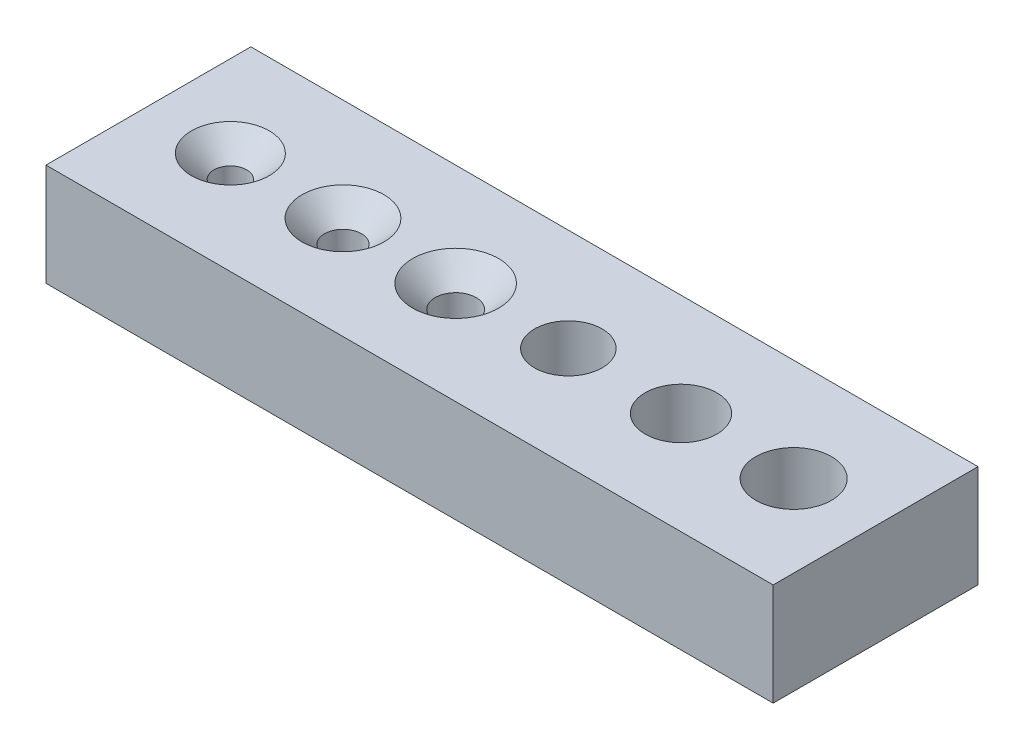
ISO-10303-21;
HEADER;
FILE_DESCRIPTION(('STEP AP214'),'2;1');
FILE_NAME('part.step','',(''),(''),'','','');
FILE_SCHEMA(('AUTOMOTIVE_DESIGN { 1 0 10303 214 1 1 1 1 }'));
ENDSEC;
DATA;
#1=APPLICATION_CONTEXT('core data for automotive mechanical design processes');
#2=APPLICATION_PROTOCOL_DEFINITION('international standard','automotive_design',2000,#1);
#3=PRODUCT_CONTEXT('',#1,'mechanical');
#4=PRODUCT('Part','Part','',(#3));
#5=PRODUCT_RELATED_PRODUCT_CATEGORY('part','',(#4));
#6=PRODUCT_DEFINITION_FORMATION('','',#4);
#7=PRODUCT_DEFINITION_CONTEXT('part definition',#1,'design');
#8=PRODUCT_DEFINITION('design','',#6,#7);
#9=PRODUCT_DEFINITION_SHAPE('','',#8);
#10=(LENGTH_UNIT() NAMED_UNIT(*) SI_UNIT(.MILLI.,.METRE.));
#11=(NAMED_UNIT(*) PLANE_ANGLE_UNIT() SI_UNIT($,.RADIAN.));
#12=(NAMED_UNIT(*) SI_UNIT($,.STERADIAN.) SOLID_ANGLE_UNIT());
#13=UNCERTAINTY_MEASURE_WITH_UNIT(LENGTH_MEASURE(1.E-05),#10,'distance_accuracy_value','');
#14=(GEOMETRIC_REPRESENTATION_CONTEXT(3) GLOBAL_UNCERTAINTY_ASSIGNED_CONTEXT((#13)) GLOBAL_UNIT_ASSIGNED_CONTEXT((#10,
#11,#12)) REPRESENTATION_CONTEXT('',''));
#15=CARTESIAN_POINT('',(0.,0.,0.));
#16=DIRECTION('',(0.,0.,1.));
#17=DIRECTION('',(1.,0.,0.));
#18=AXIS2_PLACEMENT_3D('',#15,#16,#17);
#19=CARTESIAN_POINT('',(0.,5.,0.));
#20=DIRECTION('',(1.,0.,0.));
#21=DIRECTION('',(0.,0.,-1.));
#22=AXIS2_PLACEMENT_3D('',#19,#20,#21);
#23=PLANE('',#22);
#24=DIRECTION('',(0.,0.,1.));
#25=VECTOR('',#24,1.);
#26=CARTESIAN_POINT('',(0.,0.,0.));
#27=LINE('',#26,#25);
#28=CARTESIAN_POINT('',(0.,0.,-10.));
#29=VERTEX_POINT('',#28);
#30=CARTESIAN_POINT('',(0.,0.,0.));
#31=VERTEX_POINT('',#30);
#32=EDGE_CURVE('E102',#29,#31,#27,.T.);
#33=ORIENTED_EDGE('',*,*,#32,.T.);
#34=DIRECTION('',(0.,-1.,0.));
#35=VECTOR('',#34,1.);
#36=CARTESIAN_POINT('',(0.,5.,0.));
#37=LINE('',#36,#35);
#38=CARTESIAN_POINT('',(0.,5.,0.));
#39=VERTEX_POINT('',#38);
#40=EDGE_CURVE('E11',#39,#31,#37,.T.);
#41=ORIENTED_EDGE('',*,*,#40,.F.);
#42=DIRECTION('',(0.,0.,1.));
#43=VECTOR('',#42,1.);
#44=CARTESIAN_POINT('',(0.,5.,0.));
#45=LINE('',#44,#43);
#46=CARTESIAN_POINT('',(0.,5.,-10.));
#47=VERTEX_POINT('',#46);
#48=EDGE_CURVE('E89',#47,#39,#45,.T.);
#49=ORIENTED_EDGE('',*,*,#48,.F.);
#50=DIRECTION('',(0.,-1.,0.));
#51=VECTOR('',#50,1.);
#52=CARTESIAN_POINT('',(0.,5.,-10.));
#53=LINE('',#52,#51);
#54=EDGE_CURVE('E98',#47,#29,#53,.T.);
#55=ORIENTED_EDGE('',*,*,#54,.T.);
#56=EDGE_LOOP('',(#33,#41,#49,#55));
#57=FACE_BOUND('',#56,.T.);
#58=ADVANCED_FACE('F36',(#57),#23,.F.);
#59=CARTESIAN_POINT('',(0.,5.,0.));
#60=DIRECTION('',(0.,0.,-1.));
#61=DIRECTION('',(-1.,0.,0.));
#62=AXIS2_PLACEMENT_3D('',#59,#60,#61);
#63=PLANE('',#62);
#64=DIRECTION('',(1.,0.,0.));
#65=VECTOR('',#64,1.);
#66=CARTESIAN_POINT('',(0.,0.,0.));
#67=LINE('',#66,#65);
#68=CARTESIAN_POINT('',(35.5,0.,0.));
#69=VERTEX_POINT('',#68);
#70=EDGE_CURVE('E93',#31,#69,#67,.T.);
#71=ORIENTED_EDGE('',*,*,#70,.T.);
#72=DIRECTION('',(0.,-1.,0.));
#73=VECTOR('',#72,1.);
#74=CARTESIAN_POINT('',(35.5,5.,0.));
#75=LINE('',#74,#73);
#76=CARTESIAN_POINT('',(35.5,5.,0.));
#77=VERTEX_POINT('',#76);
#78=EDGE_CURVE('E45',#77,#69,#75,.T.);
#79=ORIENTED_EDGE('',*,*,#78,.F.);
#80=DIRECTION('',(1.,0.,0.));
#81=VECTOR('',#80,1.);
#82=CARTESIAN_POINT('',(0.,5.,0.));
#83=LINE('',#82,#81);
#84=EDGE_CURVE('E84',#39,#77,#83,.T.);
#85=ORIENTED_EDGE('',*,*,#84,.F.);
#86=ORIENTED_EDGE('',*,*,#40,.T.);
#87=EDGE_LOOP('',(#71,#79,#85,#86));
#88=FACE_BOUND('',#87,.T.);
#89=ADVANCED_FACE('F92',(#88),#63,.F.);
#90=CARTESIAN_POINT('',(35.5,5.,0.));
#91=DIRECTION('',(-1.,0.,0.));
#92=DIRECTION('',(0.,0.,1.));
#93=AXIS2_PLACEMENT_3D('',#90,#91,#92);
#94=PLANE('',#93);
#95=DIRECTION('',(0.,0.,-1.));
#96=VECTOR('',#95,1.);
#97=CARTESIAN_POINT('',(35.5,0.,0.));
#98=LINE('',#97,#96);
#99=CARTESIAN_POINT('',(35.5,0.,-10.));
#100=VERTEX_POINT('',#99);
#101=EDGE_CURVE('E71',#69,#100,#98,.T.);
#102=ORIENTED_EDGE('',*,*,#101,.T.);
#103=DIRECTION('',(0.,-1.,0.));
#104=VECTOR('',#103,1.);
#105=CARTESIAN_POINT('',(35.5,5.,-10.));
#106=LINE('',#105,#104);
#107=CARTESIAN_POINT('',(35.5,5.,-10.));
#108=VERTEX_POINT('',#107);
#109=EDGE_CURVE('E94',#108,#100,#106,.T.);
#110=ORIENTED_EDGE('',*,*,#109,.F.);
#111=DIRECTION('',(0.,0.,-1.));
#112=VECTOR('',#111,1.);
#113=CARTESIAN_POINT('',(35.5,5.,0.));
#114=LINE('',#113,#112);
#115=EDGE_CURVE('E87',#77,#108,#114,.T.);
#116=ORIENTED_EDGE('',*,*,#115,.F.);
#117=ORIENTED_EDGE('',*,*,#78,.T.);
#118=EDGE_LOOP('',(#102,#110,#116,#117));
#119=FACE_BOUND('',#118,.T.);
#120=ADVANCED_FACE('F96',(#119),#94,.F.);
#121=CARTESIAN_POINT('',(0.,5.,-10.));
#122=DIRECTION('',(0.,0.,1.));
#123=DIRECTION('',(1.,0.,0.));
#124=AXIS2_PLACEMENT_3D('',#121,#122,#123);
#125=PLANE('',#124);
#126=DIRECTION('',(-1.,0.,0.));
#127=VECTOR('',#126,1.);
#128=CARTESIAN_POINT('',(0.,0.,-10.));
#129=LINE('',#128,#127);
#130=EDGE_CURVE('E77',#100,#29,#129,.T.);
#131=ORIENTED_EDGE('',*,*,#130,.T.);
#132=ORIENTED_EDGE('',*,*,#54,.F.);
#133=DIRECTION('',(-1.,0.,0.));
#134=VECTOR('',#133,1.);
#135=CARTESIAN_POINT('',(0.,5.,-10.));
#136=LINE('',#135,#134);
#137=EDGE_CURVE('E54',#108,#47,#136,.T.);
#138=ORIENTED_EDGE('',*,*,#137,.F.);
#139=ORIENTED_EDGE('',*,*,#109,.T.);
#140=EDGE_LOOP('',(#131,#132,#138,#139));
#141=FACE_BOUND('',#140,.T.);
#142=ADVANCED_FACE('F144',(#141),#125,.F.);
#143=CARTESIAN_POINT('',(0.,5.,0.));
#144=DIRECTION('',(0.,-1.,0.));
#145=DIRECTION('',(0.,0.,-1.));
#146=AXIS2_PLACEMENT_3D('',#143,#144,#145);
#147=PLANE('',#146);
#148=CARTESIAN_POINT('',(31.5,5.,-5.));
#149=DIRECTION('',(0.,1.,0.));
#150=DIRECTION('',(0.,0.,1.));
#151=AXIS2_PLACEMENT_3D('',#148,#149,#150);
#152=CIRCLE('',#151,1.85);
#153=CARTESIAN_POINT('',(31.5,5.,-3.15));
#154=VERTEX_POINT('',#153);
#155=EDGE_CURVE('E275',#154,#154,#152,.T.);
#156=ORIENTED_EDGE('',*,*,#155,.F.);
#157=EDGE_LOOP('',(#156));
#158=FACE_BOUND('',#157,.T.);
#159=CARTESIAN_POINT('',(26.,5.,-5.));
#160=DIRECTION('',(0.,1.,0.));
#161=DIRECTION('',(0.,0.,1.));
#162=AXIS2_PLACEMENT_3D('',#159,#160,#161);
#163=CIRCLE('',#162,1.75);
#164=CARTESIAN_POINT('',(26.,5.,-3.25));
#165=VERTEX_POINT('',#164);
#166=EDGE_CURVE('E277',#165,#165,#163,.T.);
#167=ORIENTED_EDGE('',*,*,#166,.F.);
#168=EDGE_LOOP('',(#167));
#169=FACE_BOUND('',#168,.T.);
#170=CARTESIAN_POINT('',(20.5,5.,-5.));
#171=DIRECTION('',(0.,1.,0.));
#172=DIRECTION('',(0.,0.,1.));
#173=AXIS2_PLACEMENT_3D('',#170,#171,#172);
#174=CIRCLE('',#173,1.64999999999999);
#175=CARTESIAN_POINT('',(20.5,5.,-3.35000000000001));
#176=VERTEX_POINT('',#175);
#177=EDGE_CURVE('E285',#176,#176,#174,.T.);
#178=ORIENTED_EDGE('',*,*,#177,.F.);
#179=EDGE_LOOP('',(#178));
#180=FACE_BOUND('',#179,.T.);
#181=CARTESIAN_POINT('',(4.,5.,-5.));
#182=DIRECTION('',(0.,1.,0.));
#183=DIRECTION('',(0.,0.,1.));
#184=AXIS2_PLACEMENT_3D('',#181,#182,#183);
#185=CIRCLE('',#184,1.9);
#186=CARTESIAN_POINT('',(4.,5.,-3.1));
#187=VERTEX_POINT('',#186);
#188=EDGE_CURVE('E291',#187,#187,#185,.T.);
#189=ORIENTED_EDGE('',*,*,#188,.F.);
#190=EDGE_LOOP('',(#189));
#191=FACE_BOUND('',#190,.T.);
#192=CARTESIAN_POINT('',(15.,5.,-5.));
#193=DIRECTION('',(0.,1.,0.));
#194=DIRECTION('',(0.,0.,1.));
#195=AXIS2_PLACEMENT_3D('',#192,#193,#194);
#196=CIRCLE('',#195,2.1);
#197=CARTESIAN_POINT('',(15.,5.,-2.9));
#198=VERTEX_POINT('',#197);
#199=EDGE_CURVE('E122',#198,#198,#196,.T.);
#200=ORIENTED_EDGE('',*,*,#199,.F.);
#201=EDGE_LOOP('',(#200));
#202=FACE_BOUND('',#201,.T.);
#203=CARTESIAN_POINT('',(9.5,5.,-5.));
#204=DIRECTION('',(0.,1.,0.));
#205=DIRECTION('',(0.,0.,1.));
#206=AXIS2_PLACEMENT_3D('',#203,#204,#205);
#207=CIRCLE('',#206,2.);
#208=CARTESIAN_POINT('',(9.5,5.,-3.));
#209=VERTEX_POINT('',#208);
#210=EDGE_CURVE('E115',#209,#209,#207,.T.);
#211=ORIENTED_EDGE('',*,*,#210,.F.);
#212=EDGE_LOOP('',(#211));
#213=FACE_BOUND('',#212,.T.);
#214=ORIENTED_EDGE('',*,*,#48,.T.);
#215=ORIENTED_EDGE('',*,*,#84,.T.);
#216=ORIENTED_EDGE('',*,*,#115,.T.);
#217=ORIENTED_EDGE('',*,*,#137,.T.);
#218=EDGE_LOOP('',(#214,#215,#216,#217));
#219=FACE_BOUND('',#218,.T.);
#220=ADVANCED_FACE('F85',(#158,#169,#180,#191,#202,#213,#219),#147,.F.);
#221=CARTESIAN_POINT('',(0.,0.,0.));
#222=DIRECTION('',(0.,-1.,0.));
#223=DIRECTION('',(0.,0.,-1.));
#224=AXIS2_PLACEMENT_3D('',#221,#222,#223);
#225=PLANE('',#224);
#226=CARTESIAN_POINT('',(31.5,0.,-5.));
#227=DIRECTION('',(0.,1.,0.));
#228=DIRECTION('',(0.,0.,1.));
#229=AXIS2_PLACEMENT_3D('',#226,#227,#228);
#230=CIRCLE('',#229,1.85);
#231=CARTESIAN_POINT('',(31.5,0.,-3.15));
#232=VERTEX_POINT('',#231);
#233=EDGE_CURVE('E273',#232,#232,#230,.T.);
#234=ORIENTED_EDGE('',*,*,#233,.T.);
#235=EDGE_LOOP('',(#234));
#236=FACE_BOUND('',#235,.T.);
#237=CARTESIAN_POINT('',(26.,0.,-5.));
#238=DIRECTION('',(0.,1.,0.));
#239=DIRECTION('',(0.,0.,1.));
#240=AXIS2_PLACEMENT_3D('',#237,#238,#239);
#241=CIRCLE('',#240,1.75);
#242=CARTESIAN_POINT('',(26.,0.,-3.25));
#243=VERTEX_POINT('',#242);
#244=EDGE_CURVE('E282',#243,#243,#241,.T.);
#245=ORIENTED_EDGE('',*,*,#244,.T.);
#246=EDGE_LOOP('',(#245));
#247=FACE_BOUND('',#246,.T.);
#248=CARTESIAN_POINT('',(20.5,0.,-5.));
#249=DIRECTION('',(0.,1.,0.));
#250=DIRECTION('',(0.,0.,1.));
#251=AXIS2_PLACEMENT_3D('',#248,#249,#250);
#252=CIRCLE('',#251,1.65);
#253=CARTESIAN_POINT('',(20.5,0.,-3.35));
#254=VERTEX_POINT('',#253);
#255=EDGE_CURVE('E288',#254,#254,#252,.T.);
#256=ORIENTED_EDGE('',*,*,#255,.T.);
#257=EDGE_LOOP('',(#256));
#258=FACE_BOUND('',#257,.T.);
#259=CARTESIAN_POINT('',(4.,0.,-5.));
#260=DIRECTION('',(0.,-1.,0.));
#261=DIRECTION('',(0.,0.,-1.));
#262=AXIS2_PLACEMENT_3D('',#259,#260,#261);
#263=CIRCLE('',#262,0.799999999999999);
#264=CARTESIAN_POINT('',(4.,0.,-5.8));
#265=VERTEX_POINT('',#264);
#266=EDGE_CURVE('E39',#265,#265,#263,.T.);
#267=ORIENTED_EDGE('',*,*,#266,.F.);
#268=EDGE_LOOP('',(#267));
#269=FACE_BOUND('',#268,.T.);
#270=CARTESIAN_POINT('',(15.,0.,-5.));
#271=DIRECTION('',(0.,-1.,0.));
#272=DIRECTION('',(0.,0.,-1.));
#273=AXIS2_PLACEMENT_3D('',#270,#271,#272);
#274=CIRCLE('',#273,0.999999999999997);
#275=CARTESIAN_POINT('',(15.,0.,-6.));
#276=VERTEX_POINT('',#275);
#277=EDGE_CURVE('E113',#276,#276,#274,.T.);
#278=ORIENTED_EDGE('',*,*,#277,.F.);
#279=EDGE_LOOP('',(#278));
#280=FACE_BOUND('',#279,.T.);
#281=CARTESIAN_POINT('',(9.5,0.,-5.));
#282=DIRECTION('',(0.,-1.,0.));
#283=DIRECTION('',(0.,0.,-1.));
#284=AXIS2_PLACEMENT_3D('',#281,#282,#283);
#285=CIRCLE('',#284,0.899999999999994);
#286=CARTESIAN_POINT('',(9.5,0.,-5.89999999999999));
#287=VERTEX_POINT('',#286);
#288=EDGE_CURVE('E105',#287,#287,#285,.T.);
#289=ORIENTED_EDGE('',*,*,#288,.F.);
#290=EDGE_LOOP('',(#289));
#291=FACE_BOUND('',#290,.T.);
#292=ORIENTED_EDGE('',*,*,#32,.F.);
#293=ORIENTED_EDGE('',*,*,#130,.F.);
#294=ORIENTED_EDGE('',*,*,#101,.F.);
#295=ORIENTED_EDGE('',*,*,#70,.F.);
#296=EDGE_LOOP('',(#292,#293,#294,#295));
#297=FACE_BOUND('',#296,.T.);
#298=ADVANCED_FACE('F143',(#236,#247,#258,#269,#280,#291,#297),#225,.T.);
#299=CARTESIAN_POINT('',(9.5,5.,-5.));
#300=DIRECTION('',(0.,1.,0.));
#301=DIRECTION('',(0.,0.,1.));
#302=AXIS2_PLACEMENT_3D('',#299,#300,#301);
#303=CYLINDRICAL_SURFACE('',#302,0.899999999999994);
#304=ORIENTED_EDGE('',*,*,#288,.T.);
#305=EDGE_LOOP('',(#304));
#306=FACE_BOUND('',#305,.T.);
#307=CARTESIAN_POINT('',(9.5,3.9,-5.));
#308=DIRECTION('',(0.,1.,0.));
#309=DIRECTION('',(0.,0.,1.));
#310=AXIS2_PLACEMENT_3D('',#307,#308,#309);
#311=CIRCLE('',#310,0.9);
#312=CARTESIAN_POINT('',(9.5,3.9,-4.1));
#313=VERTEX_POINT('',#312);
#314=EDGE_CURVE('E112',#313,#313,#311,.T.);
#315=ORIENTED_EDGE('',*,*,#314,.T.);
#316=EDGE_LOOP('',(#315));
#317=FACE_BOUND('',#316,.T.);
#318=ADVANCED_FACE('F133',(#306,#317),#303,.F.);
#319=CARTESIAN_POINT('',(9.5,5.,-5.));
#320=DIRECTION('',(0.,1.,0.));
#321=DIRECTION('',(0.,0.,1.));
#322=AXIS2_PLACEMENT_3D('',#319,#320,#321);
#323=CONICAL_SURFACE('',#322,2.,0.785398163397448);
#324=ORIENTED_EDGE('',*,*,#314,.F.);
#325=EDGE_LOOP('',(#324));
#326=FACE_BOUND('',#325,.T.);
#327=ORIENTED_EDGE('',*,*,#210,.T.);
#328=EDGE_LOOP('',(#327));
#329=FACE_BOUND('',#328,.T.);
#330=ADVANCED_FACE('F135',(#326,#329),#323,.F.);
#331=CARTESIAN_POINT('',(15.,5.,-5.));
#332=DIRECTION('',(0.,1.,0.));
#333=DIRECTION('',(0.,0.,1.));
#334=AXIS2_PLACEMENT_3D('',#331,#332,#333);
#335=CYLINDRICAL_SURFACE('',#334,0.999999999999997);
#336=ORIENTED_EDGE('',*,*,#277,.T.);
#337=EDGE_LOOP('',(#336));
#338=FACE_BOUND('',#337,.T.);
#339=CARTESIAN_POINT('',(15.,3.9,-5.));
#340=DIRECTION('',(0.,1.,0.));
#341=DIRECTION('',(0.,0.,1.));
#342=AXIS2_PLACEMENT_3D('',#339,#340,#341);
#343=CIRCLE('',#342,0.999999999999997);
#344=CARTESIAN_POINT('',(15.,3.9,-4.));
#345=VERTEX_POINT('',#344);
#346=EDGE_CURVE('E116',#345,#345,#343,.T.);
#347=ORIENTED_EDGE('',*,*,#346,.T.);
#348=EDGE_LOOP('',(#347));
#349=FACE_BOUND('',#348,.T.);
#350=ADVANCED_FACE('F138',(#338,#349),#335,.F.);
#351=CARTESIAN_POINT('',(15.,5.,-5.));
#352=DIRECTION('',(0.,1.,0.));
#353=DIRECTION('',(0.,0.,1.));
#354=AXIS2_PLACEMENT_3D('',#351,#352,#353);
#355=CONICAL_SURFACE('',#354,2.1,0.78539816339745);
#356=ORIENTED_EDGE('',*,*,#346,.F.);
#357=EDGE_LOOP('',(#356));
#358=FACE_BOUND('',#357,.T.);
#359=ORIENTED_EDGE('',*,*,#199,.T.);
#360=EDGE_LOOP('',(#359));
#361=FACE_BOUND('',#360,.T.);
#362=ADVANCED_FACE('F199',(#358,#361),#355,.F.);
#363=CARTESIAN_POINT('',(4.,5.,-5.));
#364=DIRECTION('',(0.,1.,0.));
#365=DIRECTION('',(0.,0.,1.));
#366=AXIS2_PLACEMENT_3D('',#363,#364,#365);
#367=CYLINDRICAL_SURFACE('',#366,0.799999999999999);
#368=ORIENTED_EDGE('',*,*,#266,.T.);
#369=EDGE_LOOP('',(#368));
#370=FACE_BOUND('',#369,.T.);
#371=CARTESIAN_POINT('',(4.,3.9,-5.));
#372=DIRECTION('',(0.,1.,0.));
#373=DIRECTION('',(0.,0.,1.));
#374=AXIS2_PLACEMENT_3D('',#371,#372,#373);
#375=CIRCLE('',#374,0.799999999999999);
#376=CARTESIAN_POINT('',(4.,3.9,-4.2));
#377=VERTEX_POINT('',#376);
#378=EDGE_CURVE('E293',#377,#377,#375,.T.);
#379=ORIENTED_EDGE('',*,*,#378,.T.);
#380=EDGE_LOOP('',(#379));
#381=FACE_BOUND('',#380,.T.);
#382=ADVANCED_FACE('F208',(#370,#381),#367,.F.);
#383=CARTESIAN_POINT('',(4.,5.,-5.));
#384=DIRECTION('',(0.,1.,0.));
#385=DIRECTION('',(0.,0.,1.));
#386=AXIS2_PLACEMENT_3D('',#383,#384,#385);
#387=CONICAL_SURFACE('',#386,1.9,0.785398163397449);
#388=ORIENTED_EDGE('',*,*,#378,.F.);
#389=EDGE_LOOP('',(#388));
#390=FACE_BOUND('',#389,.T.);
#391=ORIENTED_EDGE('',*,*,#188,.T.);
#392=EDGE_LOOP('',(#391));
#393=FACE_BOUND('',#392,.T.);
#394=ADVANCED_FACE('F218',(#390,#393),#387,.F.);
#395=CARTESIAN_POINT('',(20.5,5.,-5.));
#396=DIRECTION('',(0.,1.,0.));
#397=DIRECTION('',(0.,0.,1.));
#398=AXIS2_PLACEMENT_3D('',#395,#396,#397);
#399=CYLINDRICAL_SURFACE('',#398,1.64999999999999);
#400=ORIENTED_EDGE('',*,*,#255,.F.);
#401=EDGE_LOOP('',(#400));
#402=FACE_BOUND('',#401,.T.);
#403=ORIENTED_EDGE('',*,*,#177,.T.);
#404=EDGE_LOOP('',(#403));
#405=FACE_BOUND('',#404,.T.);
#406=ADVANCED_FACE('F228',(#402,#405),#399,.F.);
#407=CARTESIAN_POINT('',(26.,5.,-5.));
#408=DIRECTION('',(0.,1.,0.));
#409=DIRECTION('',(0.,0.,1.));
#410=AXIS2_PLACEMENT_3D('',#407,#408,#409);
#411=CYLINDRICAL_SURFACE('',#410,1.75);
#412=ORIENTED_EDGE('',*,*,#244,.F.);
#413=EDGE_LOOP('',(#412));
#414=FACE_BOUND('',#413,.T.);
#415=ORIENTED_EDGE('',*,*,#166,.T.);
#416=EDGE_LOOP('',(#415));
#417=FACE_BOUND('',#416,.T.);
#418=ADVANCED_FACE('F238',(#414,#417),#411,.F.);
#419=CARTESIAN_POINT('',(31.5,5.,-5.));
#420=DIRECTION('',(0.,1.,0.));
#421=DIRECTION('',(0.,0.,1.));
#422=AXIS2_PLACEMENT_3D('',#419,#420,#421);
#423=CYLINDRICAL_SURFACE('',#422,1.85);
#424=ORIENTED_EDGE('',*,*,#233,.F.);
#425=EDGE_LOOP('',(#424));
#426=FACE_BOUND('',#425,.T.);
#427=ORIENTED_EDGE('',*,*,#155,.T.);
#428=EDGE_LOOP('',(#427));
#429=FACE_BOUND('',#428,.T.);
#430=ADVANCED_FACE('F247',(#426,#429),#423,.F.);
#431=CLOSED_SHELL('',(#58,#89,#120,#142,#220,#298,#318,#330,#350,#362,#382,#394,#406,#418,#430));
#432=MANIFOLD_SOLID_BREP('B2',#431);
#433=ADVANCED_BREP_SHAPE_REPRESENTATION('',(#18,#432),#14);
#434=SHAPE_DEFINITION_REPRESENTATION(#9,#433);
ENDSEC;
END-ISO-10303-21;
